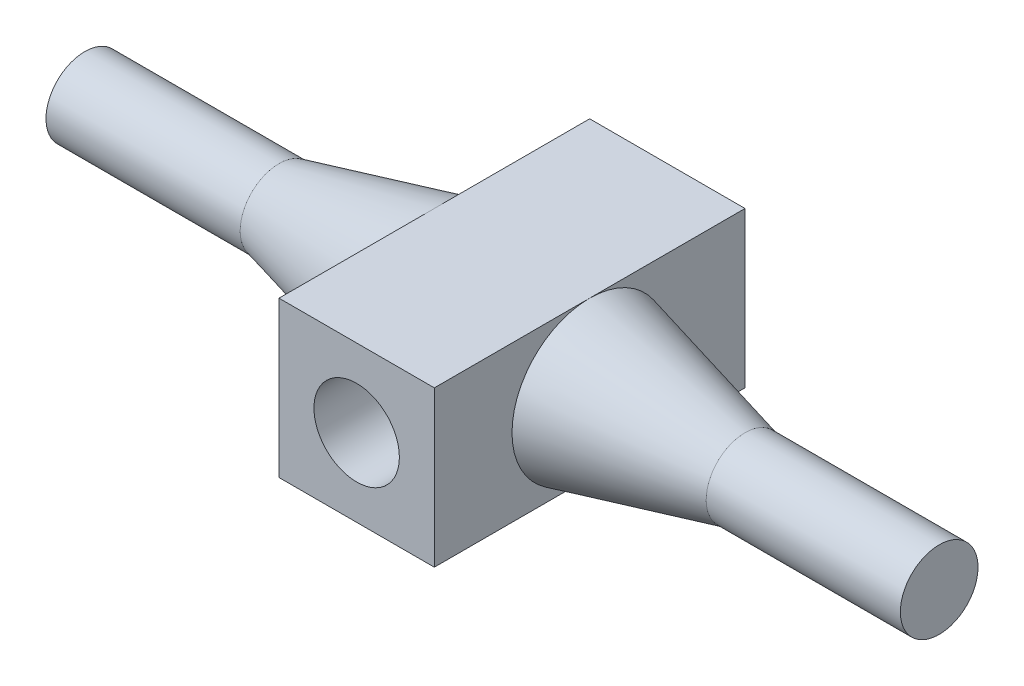
ISO-10303-21;
HEADER;
FILE_DESCRIPTION(('STEP AP214'),'2;1');
FILE_NAME('part.step','',(''),(''),'','','');
FILE_SCHEMA(('AUTOMOTIVE_DESIGN { 1 0 10303 214 1 1 1 1 }'));
ENDSEC;
DATA;
#1=APPLICATION_CONTEXT('core data for automotive mechanical design processes');
#2=APPLICATION_PROTOCOL_DEFINITION('international standard','automotive_design',2000,#1);
#3=PRODUCT_CONTEXT('',#1,'mechanical');
#4=PRODUCT('Part','Part','',(#3));
#5=PRODUCT_RELATED_PRODUCT_CATEGORY('part','',(#4));
#6=PRODUCT_DEFINITION_FORMATION('','',#4);
#7=PRODUCT_DEFINITION_CONTEXT('part definition',#1,'design');
#8=PRODUCT_DEFINITION('design','',#6,#7);
#9=PRODUCT_DEFINITION_SHAPE('','',#8);
#10=(LENGTH_UNIT() NAMED_UNIT(*) SI_UNIT(.MILLI.,.METRE.));
#11=(NAMED_UNIT(*) PLANE_ANGLE_UNIT() SI_UNIT($,.RADIAN.));
#12=(NAMED_UNIT(*) SI_UNIT($,.STERADIAN.) SOLID_ANGLE_UNIT());
#13=UNCERTAINTY_MEASURE_WITH_UNIT(LENGTH_MEASURE(1.E-05),#10,'distance_accuracy_value','');
#14=(GEOMETRIC_REPRESENTATION_CONTEXT(3) GLOBAL_UNCERTAINTY_ASSIGNED_CONTEXT((#13)) GLOBAL_UNIT_ASSIGNED_CONTEXT((#10,
#11,#12)) REPRESENTATION_CONTEXT('',''));
#15=CARTESIAN_POINT('',(0.,0.,0.));
#16=DIRECTION('',(0.,0.,1.));
#17=DIRECTION('',(1.,0.,0.));
#18=AXIS2_PLACEMENT_3D('',#15,#16,#17);
#19=CARTESIAN_POINT('',(-1.,-1.,4.));
#20=DIRECTION('',(1.,0.,0.));
#21=DIRECTION('',(0.,0.,-1.));
#22=AXIS2_PLACEMENT_3D('',#19,#20,#21);
#23=PLANE('',#22);
#24=DIRECTION('',(0.,0.,-1.));
#25=VECTOR('',#24,1.);
#26=CARTESIAN_POINT('',(-1.,1.,4.));
#27=LINE('',#26,#25);
#28=CARTESIAN_POINT('',(-1.,1.,4.));
#29=VERTEX_POINT('',#28);
#30=CARTESIAN_POINT('',(-1.,1.,2.));
#31=VERTEX_POINT('',#30);
#32=EDGE_CURVE('E97',#29,#31,#27,.T.);
#33=ORIENTED_EDGE('',*,*,#32,.T.);
#34=CARTESIAN_POINT('',(-1.,0.,2.));
#35=DIRECTION('',(1.,0.,0.));
#36=DIRECTION('',(0.,1.,0.));
#37=AXIS2_PLACEMENT_3D('',#34,#35,#36);
#38=CIRCLE('',#37,1.);
#39=CARTESIAN_POINT('',(-1.,-1.,2.));
#40=VERTEX_POINT('',#39);
#41=EDGE_CURVE('E47',#31,#40,#38,.T.);
#42=ORIENTED_EDGE('',*,*,#41,.T.);
#43=DIRECTION('',(0.,0.,-1.));
#44=VECTOR('',#43,1.);
#45=CARTESIAN_POINT('',(-1.,-1.,4.));
#46=LINE('',#45,#44);
#47=CARTESIAN_POINT('',(-1.,-1.,4.));
#48=VERTEX_POINT('',#47);
#49=EDGE_CURVE('E40',#48,#40,#46,.T.);
#50=ORIENTED_EDGE('',*,*,#49,.F.);
#51=DIRECTION('',(0.,-1.,0.));
#52=VECTOR('',#51,1.);
#53=CARTESIAN_POINT('',(-1.,-1.,4.));
#54=LINE('',#53,#52);
#55=EDGE_CURVE('E314',#29,#48,#54,.T.);
#56=ORIENTED_EDGE('',*,*,#55,.F.);
#57=EDGE_LOOP('',(#33,#42,#50,#56));
#58=FACE_BOUND('',#57,.T.);
#59=ADVANCED_FACE('F36',(#58),#23,.F.);
#60=CARTESIAN_POINT('',(1.,-1.,4.));
#61=DIRECTION('',(-1.,0.,0.));
#62=DIRECTION('',(0.,0.,1.));
#63=AXIS2_PLACEMENT_3D('',#60,#61,#62);
#64=PLANE('',#63);
#65=CARTESIAN_POINT('',(0.999999999999993,0.,2.));
#66=DIRECTION('',(1.,0.,0.));
#67=DIRECTION('',(0.,1.,0.));
#68=AXIS2_PLACEMENT_3D('',#65,#66,#67);
#69=CIRCLE('',#68,1.);
#70=CARTESIAN_POINT('',(0.999999999999993,1.,2.));
#71=VERTEX_POINT('',#70);
#72=CARTESIAN_POINT('',(0.999999999999993,-1.,2.));
#73=VERTEX_POINT('',#72);
#74=EDGE_CURVE('E112',#71,#73,#69,.T.);
#75=ORIENTED_EDGE('',*,*,#74,.F.);
#76=DIRECTION('',(0.,0.,-1.));
#77=VECTOR('',#76,1.);
#78=CARTESIAN_POINT('',(1.,1.,4.));
#79=LINE('',#78,#77);
#80=CARTESIAN_POINT('',(1.,1.,4.));
#81=VERTEX_POINT('',#80);
#82=EDGE_CURVE('E331',#81,#71,#79,.T.);
#83=ORIENTED_EDGE('',*,*,#82,.F.);
#84=DIRECTION('',(0.,1.,0.));
#85=VECTOR('',#84,1.);
#86=CARTESIAN_POINT('',(1.,-1.,4.));
#87=LINE('',#86,#85);
#88=CARTESIAN_POINT('',(1.,-1.,4.));
#89=VERTEX_POINT('',#88);
#90=EDGE_CURVE('E318',#89,#81,#87,.T.);
#91=ORIENTED_EDGE('',*,*,#90,.F.);
#92=DIRECTION('',(0.,0.,-1.));
#93=VECTOR('',#92,1.);
#94=CARTESIAN_POINT('',(1.,-1.,4.));
#95=LINE('',#94,#93);
#96=EDGE_CURVE('E106',#89,#73,#95,.T.);
#97=ORIENTED_EDGE('',*,*,#96,.T.);
#98=EDGE_LOOP('',(#75,#83,#91,#97));
#99=FACE_BOUND('',#98,.T.);
#100=ADVANCED_FACE('F151',(#99),#64,.F.);
#101=CARTESIAN_POINT('',(0.,0.,4.));
#102=DIRECTION('',(0.,0.,1.));
#103=DIRECTION('',(1.,0.,0.));
#104=AXIS2_PLACEMENT_3D('',#101,#102,#103);
#105=PLANE('',#104);
#106=ORIENTED_EDGE('',*,*,#55,.T.);
#107=DIRECTION('',(1.,0.,0.));
#108=VECTOR('',#107,1.);
#109=CARTESIAN_POINT('',(1.,-1.,4.));
#110=LINE('',#109,#108);
#111=EDGE_CURVE('E109',#48,#89,#110,.T.);
#112=ORIENTED_EDGE('',*,*,#111,.T.);
#113=ORIENTED_EDGE('',*,*,#90,.T.);
#114=DIRECTION('',(-1.,0.,0.));
#115=VECTOR('',#114,1.);
#116=CARTESIAN_POINT('',(1.,1.,4.));
#117=LINE('',#116,#115);
#118=EDGE_CURVE('E320',#81,#29,#117,.T.);
#119=ORIENTED_EDGE('',*,*,#118,.T.);
#120=EDGE_LOOP('',(#106,#112,#113,#119));
#121=FACE_BOUND('',#120,.T.);
#122=CARTESIAN_POINT('',(0.,0.,4.));
#123=DIRECTION('',(0.,0.,1.));
#124=DIRECTION('',(1.,0.,0.));
#125=AXIS2_PLACEMENT_3D('',#122,#123,#124);
#126=CIRCLE('',#125,0.55);
#127=CARTESIAN_POINT('',(0.55,0.,4.));
#128=VERTEX_POINT('',#127);
#129=EDGE_CURVE('E121',#128,#128,#126,.T.);
#130=ORIENTED_EDGE('',*,*,#129,.F.);
#131=EDGE_LOOP('',(#130));
#132=FACE_BOUND('',#131,.T.);
#133=ADVANCED_FACE('F155',(#121,#132),#105,.T.);
#134=CARTESIAN_POINT('',(0.,0.,0.));
#135=DIRECTION('',(0.,0.,1.));
#136=DIRECTION('',(1.,0.,0.));
#137=AXIS2_PLACEMENT_3D('',#134,#135,#136);
#138=PLANE('',#137);
#139=DIRECTION('',(0.,-1.,0.));
#140=VECTOR('',#139,1.);
#141=CARTESIAN_POINT('',(-1.,-1.,0.));
#142=LINE('',#141,#140);
#143=CARTESIAN_POINT('',(-1.,1.,0.));
#144=VERTEX_POINT('',#143);
#145=CARTESIAN_POINT('',(-1.,-1.,0.));
#146=VERTEX_POINT('',#145);
#147=EDGE_CURVE('E102',#144,#146,#142,.T.);
#148=ORIENTED_EDGE('',*,*,#147,.F.);
#149=DIRECTION('',(-1.,0.,0.));
#150=VECTOR('',#149,1.);
#151=CARTESIAN_POINT('',(1.,1.,0.));
#152=LINE('',#151,#150);
#153=CARTESIAN_POINT('',(1.,1.,0.));
#154=VERTEX_POINT('',#153);
#155=EDGE_CURVE('E316',#154,#144,#152,.T.);
#156=ORIENTED_EDGE('',*,*,#155,.F.);
#157=DIRECTION('',(0.,1.,0.));
#158=VECTOR('',#157,1.);
#159=CARTESIAN_POINT('',(1.,-1.,0.));
#160=LINE('',#159,#158);
#161=CARTESIAN_POINT('',(1.,-1.,0.));
#162=VERTEX_POINT('',#161);
#163=EDGE_CURVE('E324',#162,#154,#160,.T.);
#164=ORIENTED_EDGE('',*,*,#163,.F.);
#165=DIRECTION('',(1.,0.,0.));
#166=VECTOR('',#165,1.);
#167=CARTESIAN_POINT('',(1.,-1.,0.));
#168=LINE('',#167,#166);
#169=EDGE_CURVE('E311',#146,#162,#168,.T.);
#170=ORIENTED_EDGE('',*,*,#169,.F.);
#171=EDGE_LOOP('',(#148,#156,#164,#170));
#172=FACE_BOUND('',#171,.T.);
#173=CARTESIAN_POINT('',(0.,0.,0.));
#174=DIRECTION('',(0.,0.,1.));
#175=DIRECTION('',(1.,0.,0.));
#176=AXIS2_PLACEMENT_3D('',#173,#174,#175);
#177=CIRCLE('',#176,0.55);
#178=CARTESIAN_POINT('',(0.55,0.,0.));
#179=VERTEX_POINT('',#178);
#180=EDGE_CURVE('E117',#179,#179,#177,.T.);
#181=ORIENTED_EDGE('',*,*,#180,.T.);
#182=EDGE_LOOP('',(#181));
#183=FACE_BOUND('',#182,.T.);
#184=ADVANCED_FACE('F160',(#172,#183),#138,.F.);
#185=EDGE_CURVE('E100',#40,#146,#46,.T.);
#186=ORIENTED_EDGE('',*,*,#185,.F.);
#187=EDGE_CURVE('E11',#40,#31,#38,.T.);
#188=ORIENTED_EDGE('',*,*,#187,.T.);
#189=EDGE_CURVE('E321',#31,#144,#27,.T.);
#190=ORIENTED_EDGE('',*,*,#189,.T.);
#191=ORIENTED_EDGE('',*,*,#147,.T.);
#192=EDGE_LOOP('',(#186,#188,#190,#191));
#193=FACE_BOUND('',#192,.T.);
#194=ADVANCED_FACE('F38',(#193),#23,.F.);
#195=CARTESIAN_POINT('',(1.,-1.,4.));
#196=DIRECTION('',(0.,1.,0.));
#197=DIRECTION('',(-1.,0.,0.));
#198=AXIS2_PLACEMENT_3D('',#195,#196,#197);
#199=PLANE('',#198);
#200=ORIENTED_EDGE('',*,*,#169,.T.);
#201=EDGE_CURVE('E332',#73,#162,#95,.T.);
#202=ORIENTED_EDGE('',*,*,#201,.F.);
#203=ORIENTED_EDGE('',*,*,#96,.F.);
#204=ORIENTED_EDGE('',*,*,#111,.F.);
#205=ORIENTED_EDGE('',*,*,#49,.T.);
#206=ORIENTED_EDGE('',*,*,#185,.T.);
#207=EDGE_LOOP('',(#200,#202,#203,#204,#205,#206));
#208=FACE_BOUND('',#207,.T.);
#209=ADVANCED_FACE('F107',(#208),#199,.F.);
#210=EDGE_CURVE('E45',#73,#71,#69,.T.);
#211=ORIENTED_EDGE('',*,*,#210,.F.);
#212=ORIENTED_EDGE('',*,*,#201,.T.);
#213=ORIENTED_EDGE('',*,*,#163,.T.);
#214=EDGE_CURVE('E330',#71,#154,#79,.T.);
#215=ORIENTED_EDGE('',*,*,#214,.F.);
#216=EDGE_LOOP('',(#211,#212,#213,#215));
#217=FACE_BOUND('',#216,.T.);
#218=ADVANCED_FACE('F158',(#217),#64,.F.);
#219=CARTESIAN_POINT('',(1.,1.,4.));
#220=DIRECTION('',(0.,-1.,0.));
#221=DIRECTION('',(1.,0.,0.));
#222=AXIS2_PLACEMENT_3D('',#219,#220,#221);
#223=PLANE('',#222);
#224=ORIENTED_EDGE('',*,*,#155,.T.);
#225=ORIENTED_EDGE('',*,*,#189,.F.);
#226=ORIENTED_EDGE('',*,*,#32,.F.);
#227=ORIENTED_EDGE('',*,*,#118,.F.);
#228=ORIENTED_EDGE('',*,*,#82,.T.);
#229=ORIENTED_EDGE('',*,*,#214,.T.);
#230=EDGE_LOOP('',(#224,#225,#226,#227,#228,#229));
#231=FACE_BOUND('',#230,.T.);
#232=ADVANCED_FACE('F175',(#231),#223,.F.);
#233=CARTESIAN_POINT('',(0.,0.,4.));
#234=DIRECTION('',(0.,0.,-1.));
#235=DIRECTION('',(-1.,0.,0.));
#236=AXIS2_PLACEMENT_3D('',#233,#234,#235);
#237=CYLINDRICAL_SURFACE('',#236,0.55);
#238=ORIENTED_EDGE('',*,*,#129,.T.);
#239=EDGE_LOOP('',(#238));
#240=FACE_BOUND('',#239,.T.);
#241=ORIENTED_EDGE('',*,*,#180,.F.);
#242=EDGE_LOOP('',(#241));
#243=FACE_BOUND('',#242,.T.);
#244=ADVANCED_FACE('F177',(#240,#243),#237,.F.);
#245=CARTESIAN_POINT('',(3.,0.,2.));
#246=DIRECTION('',(-1.,0.,0.));
#247=DIRECTION('',(0.,-1.,0.));
#248=AXIS2_PLACEMENT_3D('',#245,#246,#247);
#249=CONICAL_SURFACE('',#248,0.499999999999999,0.244978663126864);
#250=ORIENTED_EDGE('',*,*,#74,.T.);
#251=ORIENTED_EDGE('',*,*,#210,.T.);
#252=EDGE_LOOP('',(#250,#251));
#253=FACE_BOUND('',#252,.T.);
#254=CARTESIAN_POINT('',(3.,0.,2.));
#255=DIRECTION('',(1.,0.,0.));
#256=DIRECTION('',(0.,1.,0.));
#257=AXIS2_PLACEMENT_3D('',#254,#255,#256);
#258=CIRCLE('',#257,0.499999999999999);
#259=CARTESIAN_POINT('',(3.,0.5,2.));
#260=VERTEX_POINT('',#259);
#261=EDGE_CURVE('E124',#260,#260,#258,.T.);
#262=ORIENTED_EDGE('',*,*,#261,.F.);
#263=EDGE_LOOP('',(#262));
#264=FACE_BOUND('',#263,.T.);
#265=ADVANCED_FACE('F195',(#253,#264),#249,.T.);
#266=CARTESIAN_POINT('',(5.5,0.,2.));
#267=DIRECTION('',(1.,0.,0.));
#268=DIRECTION('',(0.,1.,0.));
#269=AXIS2_PLACEMENT_3D('',#266,#267,#268);
#270=PLANE('',#269);
#271=CARTESIAN_POINT('',(5.5,0.,2.));
#272=DIRECTION('',(1.,0.,0.));
#273=DIRECTION('',(0.,1.,0.));
#274=AXIS2_PLACEMENT_3D('',#271,#272,#273);
#275=CIRCLE('',#274,0.499999999999999);
#276=CARTESIAN_POINT('',(5.5,0.5,2.));
#277=VERTEX_POINT('',#276);
#278=EDGE_CURVE('E118',#277,#277,#275,.T.);
#279=ORIENTED_EDGE('',*,*,#278,.T.);
#280=EDGE_LOOP('',(#279));
#281=FACE_BOUND('',#280,.T.);
#282=ADVANCED_FACE('F201',(#281),#270,.T.);
#283=CARTESIAN_POINT('',(-1.,0.,2.));
#284=DIRECTION('',(1.,0.,0.));
#285=DIRECTION('',(0.,1.,0.));
#286=AXIS2_PLACEMENT_3D('',#283,#284,#285);
#287=CYLINDRICAL_SURFACE('',#286,0.499999999999999);
#288=ORIENTED_EDGE('',*,*,#261,.T.);
#289=EDGE_LOOP('',(#288));
#290=FACE_BOUND('',#289,.T.);
#291=ORIENTED_EDGE('',*,*,#278,.F.);
#292=EDGE_LOOP('',(#291));
#293=FACE_BOUND('',#292,.T.);
#294=ADVANCED_FACE('F147',(#290,#293),#287,.T.);
#295=CARTESIAN_POINT('',(-5.5,0.,2.));
#296=DIRECTION('',(-1.,0.,0.));
#297=DIRECTION('',(0.,-1.,0.));
#298=AXIS2_PLACEMENT_3D('',#295,#296,#297);
#299=PLANE('',#298);
#300=CARTESIAN_POINT('',(-5.5,0.,2.));
#301=DIRECTION('',(1.,0.,0.));
#302=DIRECTION('',(0.,1.,0.));
#303=AXIS2_PLACEMENT_3D('',#300,#301,#302);
#304=CIRCLE('',#303,0.5);
#305=CARTESIAN_POINT('',(-5.5,0.5,2.));
#306=VERTEX_POINT('',#305);
#307=EDGE_CURVE('E128',#306,#306,#304,.T.);
#308=ORIENTED_EDGE('',*,*,#307,.F.);
#309=EDGE_LOOP('',(#308));
#310=FACE_BOUND('',#309,.T.);
#311=ADVANCED_FACE('F139',(#310),#299,.T.);
#312=CARTESIAN_POINT('',(-1.,0.,2.));
#313=DIRECTION('',(1.,0.,0.));
#314=DIRECTION('',(0.,1.,0.));
#315=AXIS2_PLACEMENT_3D('',#312,#313,#314);
#316=CYLINDRICAL_SURFACE('',#315,0.5);
#317=ORIENTED_EDGE('',*,*,#307,.T.);
#318=EDGE_LOOP('',(#317));
#319=FACE_BOUND('',#318,.T.);
#320=CARTESIAN_POINT('',(-3.,0.,2.));
#321=DIRECTION('',(1.,0.,0.));
#322=DIRECTION('',(0.,1.,0.));
#323=AXIS2_PLACEMENT_3D('',#320,#321,#322);
#324=CIRCLE('',#323,0.5);
#325=CARTESIAN_POINT('',(-3.,0.5,2.));
#326=VERTEX_POINT('',#325);
#327=EDGE_CURVE('E98',#326,#326,#324,.T.);
#328=ORIENTED_EDGE('',*,*,#327,.F.);
#329=EDGE_LOOP('',(#328));
#330=FACE_BOUND('',#329,.T.);
#331=ADVANCED_FACE('F137',(#319,#330),#316,.T.);
#332=CARTESIAN_POINT('',(-1.,0.,2.));
#333=DIRECTION('',(1.,0.,0.));
#334=DIRECTION('',(0.,1.,0.));
#335=AXIS2_PLACEMENT_3D('',#332,#333,#334);
#336=CONICAL_SURFACE('',#335,1.,0.244978663126864);
#337=ORIENTED_EDGE('',*,*,#327,.T.);
#338=EDGE_LOOP('',(#337));
#339=FACE_BOUND('',#338,.T.);
#340=ORIENTED_EDGE('',*,*,#41,.F.);
#341=ORIENTED_EDGE('',*,*,#187,.F.);
#342=EDGE_LOOP('',(#340,#341));
#343=FACE_BOUND('',#342,.T.);
#344=ADVANCED_FACE('F87',(#339,#343),#336,.T.);
#345=CLOSED_SHELL('',(#59,#100,#133,#184,#194,#209,#218,#232,#244,#265,#282,#294,#311,#331,#344));
#346=MANIFOLD_SOLID_BREP('B2',#345);
#347=ADVANCED_BREP_SHAPE_REPRESENTATION('',(#18,#346),#14);
#348=SHAPE_DEFINITION_REPRESENTATION(#9,#347);
ENDSEC;
END-ISO-10303-21;
